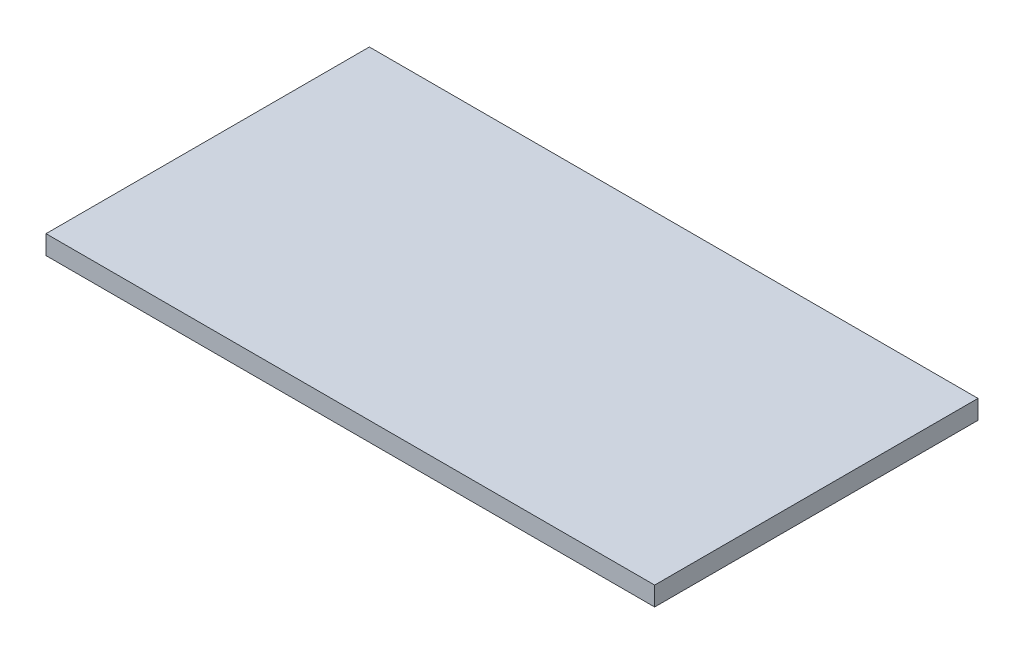
ISO-10303-21;
HEADER;
FILE_DESCRIPTION(('STEP AP214'),'2;1');
FILE_NAME('part.step','',(''),(''),'','','');
FILE_SCHEMA(('AUTOMOTIVE_DESIGN { 1 0 10303 214 1 1 1 1 }'));
ENDSEC;
DATA;
#1=APPLICATION_CONTEXT('core data for automotive mechanical design processes');
#2=APPLICATION_PROTOCOL_DEFINITION('international standard','automotive_design',2000,#1);
#3=PRODUCT_CONTEXT('',#1,'mechanical');
#4=PRODUCT('Part','Part','',(#3));
#5=PRODUCT_RELATED_PRODUCT_CATEGORY('part','',(#4));
#6=PRODUCT_DEFINITION_FORMATION('','',#4);
#7=PRODUCT_DEFINITION_CONTEXT('part definition',#1,'design');
#8=PRODUCT_DEFINITION('design','',#6,#7);
#9=PRODUCT_DEFINITION_SHAPE('','',#8);
#10=(LENGTH_UNIT() NAMED_UNIT(*) SI_UNIT(.MILLI.,.METRE.));
#11=(NAMED_UNIT(*) PLANE_ANGLE_UNIT() SI_UNIT($,.RADIAN.));
#12=(NAMED_UNIT(*) SI_UNIT($,.STERADIAN.) SOLID_ANGLE_UNIT());
#13=UNCERTAINTY_MEASURE_WITH_UNIT(LENGTH_MEASURE(1.E-05),#10,'distance_accuracy_value','');
#14=(GEOMETRIC_REPRESENTATION_CONTEXT(3) GLOBAL_UNCERTAINTY_ASSIGNED_CONTEXT((#13)) GLOBAL_UNIT_ASSIGNED_CONTEXT((#10,
#11,#12)) REPRESENTATION_CONTEXT('',''));
#15=CARTESIAN_POINT('',(0.,0.,0.));
#16=DIRECTION('',(0.,0.,1.));
#17=DIRECTION('',(1.,0.,0.));
#18=AXIS2_PLACEMENT_3D('',#15,#16,#17);
#19=CARTESIAN_POINT('',(50.8,3.175,26.9875));
#20=DIRECTION('',(-1.,0.,0.));
#21=DIRECTION('',(0.,0.,1.));
#22=AXIS2_PLACEMENT_3D('',#19,#20,#21);
#23=PLANE('',#22);
#24=DIRECTION('',(0.,0.,-1.));
#25=VECTOR('',#24,1.);
#26=CARTESIAN_POINT('',(50.8,0.,26.9875));
#27=LINE('',#26,#25);
#28=CARTESIAN_POINT('',(50.8,0.,26.9875));
#29=VERTEX_POINT('',#28);
#30=CARTESIAN_POINT('',(50.8,0.,-26.9875));
#31=VERTEX_POINT('',#30);
#32=EDGE_CURVE('E113',#29,#31,#27,.T.);
#33=ORIENTED_EDGE('',*,*,#32,.T.);
#34=DIRECTION('',(0.,-1.,0.));
#35=VECTOR('',#34,1.);
#36=CARTESIAN_POINT('',(50.8,3.175,-26.9875));
#37=LINE('',#36,#35);
#38=CARTESIAN_POINT('',(50.8,3.175,-26.9875));
#39=VERTEX_POINT('',#38);
#40=EDGE_CURVE('E11',#39,#31,#37,.T.);
#41=ORIENTED_EDGE('',*,*,#40,.F.);
#42=DIRECTION('',(0.,0.,-1.));
#43=VECTOR('',#42,1.);
#44=CARTESIAN_POINT('',(50.8,3.175,26.9875));
#45=LINE('',#44,#43);
#46=CARTESIAN_POINT('',(50.8,3.175,26.9875));
#47=VERTEX_POINT('',#46);
#48=EDGE_CURVE('E97',#47,#39,#45,.T.);
#49=ORIENTED_EDGE('',*,*,#48,.F.);
#50=DIRECTION('',(0.,-1.,0.));
#51=VECTOR('',#50,1.);
#52=CARTESIAN_POINT('',(50.8,3.175,26.9875));
#53=LINE('',#52,#51);
#54=EDGE_CURVE('E109',#47,#29,#53,.T.);
#55=ORIENTED_EDGE('',*,*,#54,.T.);
#56=EDGE_LOOP('',(#33,#41,#49,#55));
#57=FACE_BOUND('',#56,.T.);
#58=ADVANCED_FACE('F45',(#57),#23,.F.);
#59=CARTESIAN_POINT('',(-50.8,3.175,-26.9875));
#60=DIRECTION('',(0.,0.,1.));
#61=DIRECTION('',(1.,0.,0.));
#62=AXIS2_PLACEMENT_3D('',#59,#60,#61);
#63=PLANE('',#62);
#64=DIRECTION('',(-1.,0.,0.));
#65=VECTOR('',#64,1.);
#66=CARTESIAN_POINT('',(-50.8,0.,-26.9875));
#67=LINE('',#66,#65);
#68=CARTESIAN_POINT('',(-50.8,0.,-26.9875));
#69=VERTEX_POINT('',#68);
#70=EDGE_CURVE('E102',#31,#69,#67,.T.);
#71=ORIENTED_EDGE('',*,*,#70,.T.);
#72=DIRECTION('',(0.,-1.,0.));
#73=VECTOR('',#72,1.);
#74=CARTESIAN_POINT('',(-50.8,3.175,-26.9875));
#75=LINE('',#74,#73);
#76=CARTESIAN_POINT('',(-50.8,3.175,-26.9875));
#77=VERTEX_POINT('',#76);
#78=EDGE_CURVE('E54',#77,#69,#75,.T.);
#79=ORIENTED_EDGE('',*,*,#78,.F.);
#80=DIRECTION('',(-1.,0.,0.));
#81=VECTOR('',#80,1.);
#82=CARTESIAN_POINT('',(-50.8,3.175,-26.9875));
#83=LINE('',#82,#81);
#84=EDGE_CURVE('E92',#39,#77,#83,.T.);
#85=ORIENTED_EDGE('',*,*,#84,.F.);
#86=ORIENTED_EDGE('',*,*,#40,.T.);
#87=EDGE_LOOP('',(#71,#79,#85,#86));
#88=FACE_BOUND('',#87,.T.);
#89=ADVANCED_FACE('F101',(#88),#63,.F.);
#90=CARTESIAN_POINT('',(-50.8,3.175,26.9875));
#91=DIRECTION('',(1.,0.,0.));
#92=DIRECTION('',(0.,0.,-1.));
#93=AXIS2_PLACEMENT_3D('',#90,#91,#92);
#94=PLANE('',#93);
#95=DIRECTION('',(0.,0.,1.));
#96=VECTOR('',#95,1.);
#97=CARTESIAN_POINT('',(-50.8,0.,26.9875));
#98=LINE('',#97,#96);
#99=CARTESIAN_POINT('',(-50.8,0.,26.9875));
#100=VERTEX_POINT('',#99);
#101=EDGE_CURVE('E79',#69,#100,#98,.T.);
#102=ORIENTED_EDGE('',*,*,#101,.T.);
#103=DIRECTION('',(0.,-1.,0.));
#104=VECTOR('',#103,1.);
#105=CARTESIAN_POINT('',(-50.8,3.175,26.9875));
#106=LINE('',#105,#104);
#107=CARTESIAN_POINT('',(-50.8,3.175,26.9875));
#108=VERTEX_POINT('',#107);
#109=EDGE_CURVE('E104',#108,#100,#106,.T.);
#110=ORIENTED_EDGE('',*,*,#109,.F.);
#111=DIRECTION('',(0.,0.,1.));
#112=VECTOR('',#111,1.);
#113=CARTESIAN_POINT('',(-50.8,3.175,26.9875));
#114=LINE('',#113,#112);
#115=EDGE_CURVE('E95',#77,#108,#114,.T.);
#116=ORIENTED_EDGE('',*,*,#115,.F.);
#117=ORIENTED_EDGE('',*,*,#78,.T.);
#118=EDGE_LOOP('',(#102,#110,#116,#117));
#119=FACE_BOUND('',#118,.T.);
#120=ADVANCED_FACE('F105',(#119),#94,.F.);
#121=CARTESIAN_POINT('',(-50.8,3.175,26.9875));
#122=DIRECTION('',(0.,0.,-1.));
#123=DIRECTION('',(-1.,0.,0.));
#124=AXIS2_PLACEMENT_3D('',#121,#122,#123);
#125=PLANE('',#124);
#126=DIRECTION('',(1.,0.,0.));
#127=VECTOR('',#126,1.);
#128=CARTESIAN_POINT('',(-50.8,0.,26.9875));
#129=LINE('',#128,#127);
#130=EDGE_CURVE('E85',#100,#29,#129,.T.);
#131=ORIENTED_EDGE('',*,*,#130,.T.);
#132=ORIENTED_EDGE('',*,*,#54,.F.);
#133=DIRECTION('',(1.,0.,0.));
#134=VECTOR('',#133,1.);
#135=CARTESIAN_POINT('',(-50.8,3.175,26.9875));
#136=LINE('',#135,#134);
#137=EDGE_CURVE('E62',#108,#47,#136,.T.);
#138=ORIENTED_EDGE('',*,*,#137,.F.);
#139=ORIENTED_EDGE('',*,*,#109,.T.);
#140=EDGE_LOOP('',(#131,#132,#138,#139));
#141=FACE_BOUND('',#140,.T.);
#142=ADVANCED_FACE('F126',(#141),#125,.F.);
#143=CARTESIAN_POINT('',(0.,3.175,0.));
#144=DIRECTION('',(0.,-1.,0.));
#145=DIRECTION('',(0.,0.,-1.));
#146=AXIS2_PLACEMENT_3D('',#143,#144,#145);
#147=PLANE('',#146);
#148=ORIENTED_EDGE('',*,*,#48,.T.);
#149=ORIENTED_EDGE('',*,*,#84,.T.);
#150=ORIENTED_EDGE('',*,*,#115,.T.);
#151=ORIENTED_EDGE('',*,*,#137,.T.);
#152=EDGE_LOOP('',(#148,#149,#150,#151));
#153=FACE_BOUND('',#152,.T.);
#154=ADVANCED_FACE('F93',(#153),#147,.F.);
#155=CARTESIAN_POINT('',(0.,0.,0.));
#156=DIRECTION('',(0.,-1.,0.));
#157=DIRECTION('',(0.,0.,-1.));
#158=AXIS2_PLACEMENT_3D('',#155,#156,#157);
#159=PLANE('',#158);
#160=ORIENTED_EDGE('',*,*,#32,.F.);
#161=ORIENTED_EDGE('',*,*,#130,.F.);
#162=ORIENTED_EDGE('',*,*,#101,.F.);
#163=ORIENTED_EDGE('',*,*,#70,.F.);
#164=EDGE_LOOP('',(#160,#161,#162,#163));
#165=FACE_BOUND('',#164,.T.);
#166=ADVANCED_FACE('F129',(#165),#159,.T.);
#167=CLOSED_SHELL('',(#58,#89,#120,#142,#154,#166));
#168=MANIFOLD_SOLID_BREP('B2',#167);
#169=ADVANCED_BREP_SHAPE_REPRESENTATION('',(#18,#168),#14);
#170=SHAPE_DEFINITION_REPRESENTATION(#9,#169);
ENDSEC;
END-ISO-10303-21;
